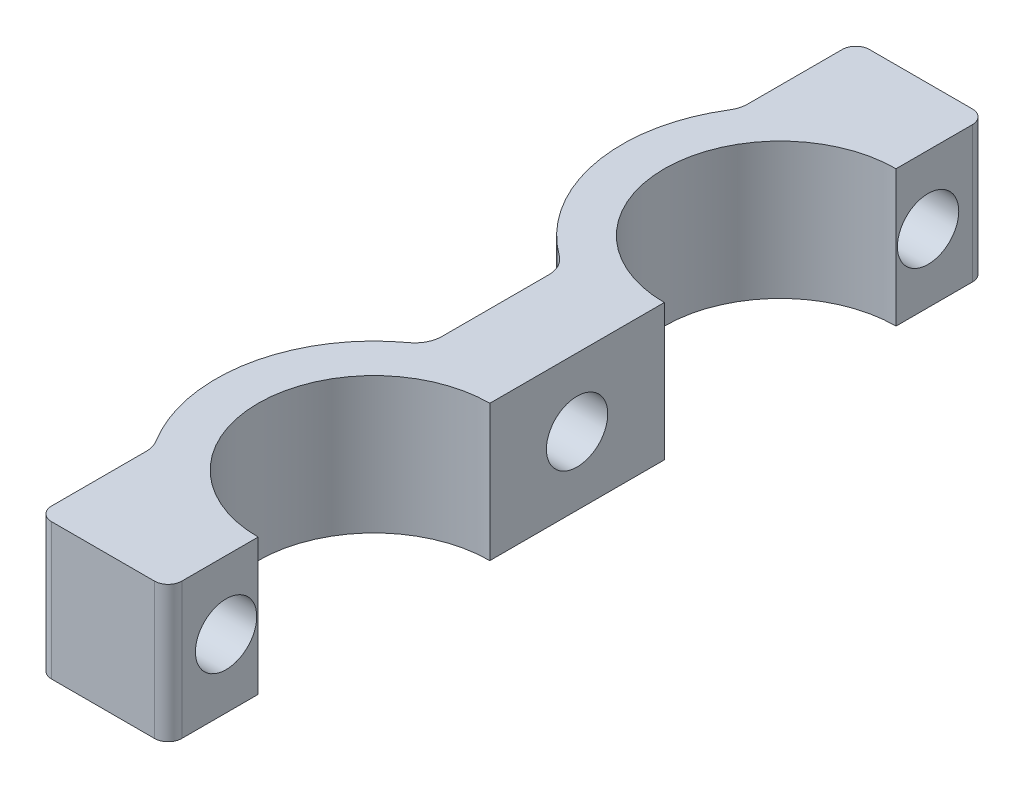
ISO-10303-21;
HEADER;
FILE_DESCRIPTION(('STEP AP214'),'2;1');
FILE_NAME('part.step','',(''),(''),'','','');
FILE_SCHEMA(('AUTOMOTIVE_DESIGN { 1 0 10303 214 1 1 1 1 }'));
ENDSEC;
DATA;
#1=APPLICATION_CONTEXT('core data for automotive mechanical design processes');
#2=APPLICATION_PROTOCOL_DEFINITION('international standard','automotive_design',2000,#1);
#3=PRODUCT_CONTEXT('',#1,'mechanical');
#4=PRODUCT('Part','Part','',(#3));
#5=PRODUCT_RELATED_PRODUCT_CATEGORY('part','',(#4));
#6=PRODUCT_DEFINITION_FORMATION('','',#4);
#7=PRODUCT_DEFINITION_CONTEXT('part definition',#1,'design');
#8=PRODUCT_DEFINITION('design','',#6,#7);
#9=PRODUCT_DEFINITION_SHAPE('','',#8);
#10=(LENGTH_UNIT() NAMED_UNIT(*) SI_UNIT(.MILLI.,.METRE.));
#11=(NAMED_UNIT(*) PLANE_ANGLE_UNIT() SI_UNIT($,.RADIAN.));
#12=(NAMED_UNIT(*) SI_UNIT($,.STERADIAN.) SOLID_ANGLE_UNIT());
#13=UNCERTAINTY_MEASURE_WITH_UNIT(LENGTH_MEASURE(1.E-05),#10,'distance_accuracy_value','');
#14=(GEOMETRIC_REPRESENTATION_CONTEXT(3) GLOBAL_UNCERTAINTY_ASSIGNED_CONTEXT((#13)) GLOBAL_UNIT_ASSIGNED_CONTEXT((#10,
#11,#12)) REPRESENTATION_CONTEXT('',''));
#15=CARTESIAN_POINT('',(0.,0.,0.));
#16=DIRECTION('',(0.,0.,1.));
#17=DIRECTION('',(1.,0.,0.));
#18=AXIS2_PLACEMENT_3D('',#15,#16,#17);
#19=CARTESIAN_POINT('',(0.,10.,0.));
#20=DIRECTION('',(-1.,0.,0.));
#21=DIRECTION('',(0.,0.,1.));
#22=AXIS2_PLACEMENT_3D('',#19,#20,#21);
#23=PLANE('',#22);
#24=DIRECTION('',(0.,0.,-1.));
#25=VECTOR('',#24,1.);
#26=CARTESIAN_POINT('',(0.,0.,0.));
#27=LINE('',#26,#25);
#28=CARTESIAN_POINT('',(0.,0.,-1.));
#29=VERTEX_POINT('',#28);
#30=CARTESIAN_POINT('',(0.,0.,-6.59999999999999));
#31=VERTEX_POINT('',#30);
#32=EDGE_CURVE('E209',#29,#31,#27,.T.);
#33=ORIENTED_EDGE('',*,*,#32,.T.);
#34=DIRECTION('',(0.,1.,0.));
#35=VECTOR('',#34,1.);
#36=CARTESIAN_POINT('',(0.,0.,-6.59999999999999));
#37=LINE('',#36,#35);
#38=CARTESIAN_POINT('',(0.,10.,-6.59999999999999));
#39=VERTEX_POINT('',#38);
#40=EDGE_CURVE('E348',#31,#39,#37,.T.);
#41=ORIENTED_EDGE('',*,*,#40,.T.);
#42=DIRECTION('',(0.,0.,-1.));
#43=VECTOR('',#42,1.);
#44=CARTESIAN_POINT('',(0.,10.,0.));
#45=LINE('',#44,#43);
#46=CARTESIAN_POINT('',(0.,10.,-1.));
#47=VERTEX_POINT('',#46);
#48=EDGE_CURVE('E333',#47,#39,#45,.T.);
#49=ORIENTED_EDGE('',*,*,#48,.F.);
#50=DIRECTION('',(0.,-1.,0.));
#51=VECTOR('',#50,1.);
#52=CARTESIAN_POINT('',(0.,10.,-1.));
#53=LINE('',#52,#51);
#54=EDGE_CURVE('E222',#47,#29,#53,.T.);
#55=ORIENTED_EDGE('',*,*,#54,.T.);
#56=EDGE_LOOP('',(#33,#41,#49,#55));
#57=FACE_BOUND('',#56,.T.);
#58=CARTESIAN_POINT('',(0.,5.,-4.25000000000001));
#59=DIRECTION('',(-1.,0.,0.));
#60=DIRECTION('',(0.,0.,-1.));
#61=AXIS2_PLACEMENT_3D('',#58,#59,#60);
#62=CIRCLE('',#61,2.25);
#63=CARTESIAN_POINT('',(0.,5.,-6.50000000000001));
#64=VERTEX_POINT('',#63);
#65=EDGE_CURVE('E221',#64,#64,#62,.T.);
#66=ORIENTED_EDGE('',*,*,#65,.T.);
#67=EDGE_LOOP('',(#66));
#68=FACE_BOUND('',#67,.T.);
#69=ADVANCED_FACE('F39',(#57,#68),#23,.F.);
#70=CARTESIAN_POINT('',(-9.54984471899927,10.,0.));
#71=DIRECTION('',(1.,0.,0.));
#72=DIRECTION('',(0.,0.,-1.));
#73=AXIS2_PLACEMENT_3D('',#70,#71,#72);
#74=PLANE('',#73);
#75=DIRECTION('',(0.,0.,1.));
#76=VECTOR('',#75,1.);
#77=CARTESIAN_POINT('',(-9.54984471899927,10.,0.));
#78=LINE('',#77,#76);
#79=CARTESIAN_POINT('',(-9.54984471899927,10.,-7.91939508349019));
#80=VERTEX_POINT('',#79);
#81=CARTESIAN_POINT('',(-9.54984471899927,10.,-1.));
#82=VERTEX_POINT('',#81);
#83=EDGE_CURVE('E312',#80,#82,#78,.T.);
#84=ORIENTED_EDGE('',*,*,#83,.F.);
#85=DIRECTION('',(0.,-1.,0.));
#86=VECTOR('',#85,1.);
#87=CARTESIAN_POINT('',(-9.54984471899927,10.,-7.91939508349019));
#88=LINE('',#87,#86);
#89=CARTESIAN_POINT('',(-9.54984471899927,0.,-7.91939508349019));
#90=VERTEX_POINT('',#89);
#91=EDGE_CURVE('E269',#80,#90,#88,.T.);
#92=ORIENTED_EDGE('',*,*,#91,.T.);
#93=DIRECTION('',(0.,0.,1.));
#94=VECTOR('',#93,1.);
#95=CARTESIAN_POINT('',(-9.54984471899927,0.,0.));
#96=LINE('',#95,#94);
#97=CARTESIAN_POINT('',(-9.54984471899927,0.,-1.));
#98=VERTEX_POINT('',#97);
#99=EDGE_CURVE('E216',#90,#98,#96,.T.);
#100=ORIENTED_EDGE('',*,*,#99,.T.);
#101=DIRECTION('',(0.,-1.,0.));
#102=VECTOR('',#101,1.);
#103=CARTESIAN_POINT('',(-9.54984471899927,10.,-1.));
#104=LINE('',#103,#102);
#105=EDGE_CURVE('E250',#98,#82,#104,.F.);
#106=ORIENTED_EDGE('',*,*,#105,.T.);
#107=EDGE_LOOP('',(#84,#92,#100,#106));
#108=FACE_BOUND('',#107,.T.);
#109=CARTESIAN_POINT('',(-9.54984471899927,5.,-4.25000000000001));
#110=DIRECTION('',(1.,0.,0.));
#111=DIRECTION('',(0.,0.,-1.));
#112=AXIS2_PLACEMENT_3D('',#109,#110,#111);
#113=CIRCLE('',#112,2.25);
#114=CARTESIAN_POINT('',(-9.54984471899927,5.,-6.50000000000001));
#115=VERTEX_POINT('',#114);
#116=EDGE_CURVE('E218',#115,#115,#113,.F.);
#117=ORIENTED_EDGE('',*,*,#116,.F.);
#118=EDGE_LOOP('',(#117));
#119=FACE_BOUND('',#118,.T.);
#120=ADVANCED_FACE('F392',(#108,#119),#74,.F.);
#121=CARTESIAN_POINT('',(0.,10.,-60.));
#122=DIRECTION('',(-1.,0.,0.));
#123=DIRECTION('',(0.,0.,1.));
#124=AXIS2_PLACEMENT_3D('',#121,#122,#123);
#125=PLANE('',#124);
#126=DIRECTION('',(0.,0.,-1.));
#127=VECTOR('',#126,1.);
#128=CARTESIAN_POINT('',(0.,10.,-60.));
#129=LINE('',#128,#127);
#130=CARTESIAN_POINT('',(0.,10.,-53.4));
#131=VERTEX_POINT('',#130);
#132=CARTESIAN_POINT('',(0.,10.,-59.));
#133=VERTEX_POINT('',#132);
#134=EDGE_CURVE('E196',#131,#133,#129,.T.);
#135=ORIENTED_EDGE('',*,*,#134,.F.);
#136=DIRECTION('',(0.,1.,0.));
#137=VECTOR('',#136,1.);
#138=CARTESIAN_POINT('',(0.,0.,-53.4));
#139=LINE('',#138,#137);
#140=CARTESIAN_POINT('',(0.,0.,-53.4));
#141=VERTEX_POINT('',#140);
#142=EDGE_CURVE('E179',#141,#131,#139,.T.);
#143=ORIENTED_EDGE('',*,*,#142,.F.);
#144=DIRECTION('',(0.,0.,-1.));
#145=VECTOR('',#144,1.);
#146=CARTESIAN_POINT('',(0.,0.,-60.));
#147=LINE('',#146,#145);
#148=CARTESIAN_POINT('',(0.,0.,-59.));
#149=VERTEX_POINT('',#148);
#150=EDGE_CURVE('E194',#141,#149,#147,.T.);
#151=ORIENTED_EDGE('',*,*,#150,.T.);
#152=DIRECTION('',(0.,-1.,0.));
#153=VECTOR('',#152,1.);
#154=CARTESIAN_POINT('',(0.,10.,-59.));
#155=LINE('',#154,#153);
#156=EDGE_CURVE('E240',#149,#133,#155,.F.);
#157=ORIENTED_EDGE('',*,*,#156,.T.);
#158=EDGE_LOOP('',(#135,#143,#151,#157));
#159=FACE_BOUND('',#158,.T.);
#160=CARTESIAN_POINT('',(0.,5.,-55.75));
#161=DIRECTION('',(-1.,0.,0.));
#162=DIRECTION('',(0.,0.,1.));
#163=AXIS2_PLACEMENT_3D('',#160,#161,#162);
#164=CIRCLE('',#163,2.25);
#165=CARTESIAN_POINT('',(0.,5.,-53.5));
#166=VERTEX_POINT('',#165);
#167=EDGE_CURVE('E217',#166,#166,#164,.T.);
#168=ORIENTED_EDGE('',*,*,#167,.T.);
#169=EDGE_LOOP('',(#168));
#170=FACE_BOUND('',#169,.T.);
#171=ADVANCED_FACE('F191',(#159,#170),#125,.F.);
#172=CARTESIAN_POINT('',(-9.54984471899922,10.,0.));
#173=DIRECTION('',(1.,0.,0.));
#174=DIRECTION('',(0.,0.,-1.));
#175=AXIS2_PLACEMENT_3D('',#172,#173,#174);
#176=PLANE('',#175);
#177=DIRECTION('',(0.,0.,1.));
#178=VECTOR('',#177,1.);
#179=CARTESIAN_POINT('',(-9.54984471899922,0.,0.));
#180=LINE('',#179,#178);
#181=CARTESIAN_POINT('',(-9.54984471899923,0.,-59.));
#182=VERTEX_POINT('',#181);
#183=CARTESIAN_POINT('',(-9.54984471899923,0.,-52.0806049165098));
#184=VERTEX_POINT('',#183);
#185=EDGE_CURVE('E316',#182,#184,#180,.T.);
#186=ORIENTED_EDGE('',*,*,#185,.T.);
#187=DIRECTION('',(0.,-1.,0.));
#188=VECTOR('',#187,1.);
#189=CARTESIAN_POINT('',(-9.54984471899923,10.,-52.0806049165098));
#190=LINE('',#189,#188);
#191=CARTESIAN_POINT('',(-9.54984471899923,10.,-52.0806049165098));
#192=VERTEX_POINT('',#191);
#193=EDGE_CURVE('E267',#184,#192,#190,.F.);
#194=ORIENTED_EDGE('',*,*,#193,.T.);
#195=DIRECTION('',(0.,0.,1.));
#196=VECTOR('',#195,1.);
#197=CARTESIAN_POINT('',(-9.54984471899922,10.,0.));
#198=LINE('',#197,#196);
#199=CARTESIAN_POINT('',(-9.54984471899923,10.,-59.));
#200=VERTEX_POINT('',#199);
#201=EDGE_CURVE('E322',#200,#192,#198,.T.);
#202=ORIENTED_EDGE('',*,*,#201,.F.);
#203=DIRECTION('',(0.,-1.,0.));
#204=VECTOR('',#203,1.);
#205=CARTESIAN_POINT('',(-9.54984471899923,10.,-59.));
#206=LINE('',#205,#204);
#207=EDGE_CURVE('E257',#200,#182,#206,.T.);
#208=ORIENTED_EDGE('',*,*,#207,.T.);
#209=EDGE_LOOP('',(#186,#194,#202,#208));
#210=FACE_BOUND('',#209,.T.);
#211=CARTESIAN_POINT('',(-9.54984471899923,5.,-55.75));
#212=DIRECTION('',(1.,0.,0.));
#213=DIRECTION('',(0.,0.,-1.));
#214=AXIS2_PLACEMENT_3D('',#211,#212,#213);
#215=CIRCLE('',#214,2.25);
#216=CARTESIAN_POINT('',(-9.54984471899923,5.,-58.));
#217=VERTEX_POINT('',#216);
#218=EDGE_CURVE('E213',#217,#217,#215,.F.);
#219=ORIENTED_EDGE('',*,*,#218,.F.);
#220=EDGE_LOOP('',(#219));
#221=FACE_BOUND('',#220,.T.);
#222=ADVANCED_FACE('F380',(#210,#221),#176,.F.);
#223=CARTESIAN_POINT('',(-3.,10.,0.));
#224=DIRECTION('',(0.,0.,-1.));
#225=DIRECTION('',(-1.,0.,0.));
#226=AXIS2_PLACEMENT_3D('',#223,#224,#225);
#227=PLANE('',#226);
#228=DIRECTION('',(1.,0.,0.));
#229=VECTOR('',#228,1.);
#230=CARTESIAN_POINT('',(-3.,10.,0.));
#231=LINE('',#230,#229);
#232=CARTESIAN_POINT('',(-8.54984471899927,10.,0.));
#233=VERTEX_POINT('',#232);
#234=CARTESIAN_POINT('',(-1.,10.,0.));
#235=VERTEX_POINT('',#234);
#236=EDGE_CURVE('E207',#233,#235,#231,.T.);
#237=ORIENTED_EDGE('',*,*,#236,.F.);
#238=DIRECTION('',(0.,-1.,0.));
#239=VECTOR('',#238,1.);
#240=CARTESIAN_POINT('',(-8.54984471899927,10.,0.));
#241=LINE('',#240,#239);
#242=CARTESIAN_POINT('',(-8.54984471899927,0.,0.));
#243=VERTEX_POINT('',#242);
#244=EDGE_CURVE('E242',#233,#243,#241,.T.);
#245=ORIENTED_EDGE('',*,*,#244,.T.);
#246=DIRECTION('',(1.,0.,0.));
#247=VECTOR('',#246,1.);
#248=CARTESIAN_POINT('',(-3.,0.,0.));
#249=LINE('',#248,#247);
#250=CARTESIAN_POINT('',(-1.,0.,0.));
#251=VERTEX_POINT('',#250);
#252=EDGE_CURVE('E325',#243,#251,#249,.T.);
#253=ORIENTED_EDGE('',*,*,#252,.T.);
#254=DIRECTION('',(0.,-1.,0.));
#255=VECTOR('',#254,1.);
#256=CARTESIAN_POINT('',(-1.,10.,0.));
#257=LINE('',#256,#255);
#258=EDGE_CURVE('E230',#251,#235,#257,.F.);
#259=ORIENTED_EDGE('',*,*,#258,.T.);
#260=EDGE_LOOP('',(#237,#245,#253,#259));
#261=FACE_BOUND('',#260,.T.);
#262=ADVANCED_FACE('F382',(#261),#227,.F.);
#263=CARTESIAN_POINT('',(0.,10.,-37.8));
#264=DIRECTION('',(-1.,0.,0.));
#265=DIRECTION('',(0.,0.,1.));
#266=AXIS2_PLACEMENT_3D('',#263,#264,#265);
#267=PLANE('',#266);
#268=CARTESIAN_POINT('',(0.,5.,-30.));
#269=DIRECTION('',(-1.,0.,0.));
#270=DIRECTION('',(0.,0.,1.));
#271=AXIS2_PLACEMENT_3D('',#268,#269,#270);
#272=CIRCLE('',#271,2.25);
#273=CARTESIAN_POINT('',(0.,5.,-27.75));
#274=VERTEX_POINT('',#273);
#275=EDGE_CURVE('E364',#274,#274,#272,.T.);
#276=ORIENTED_EDGE('',*,*,#275,.T.);
#277=EDGE_LOOP('',(#276));
#278=FACE_BOUND('',#277,.T.);
#279=DIRECTION('',(0.,0.,-1.));
#280=VECTOR('',#279,1.);
#281=CARTESIAN_POINT('',(0.,0.,-37.8));
#282=LINE('',#281,#280);
#283=CARTESIAN_POINT('',(0.,0.,-23.6));
#284=VERTEX_POINT('',#283);
#285=CARTESIAN_POINT('',(0.,0.,-36.4));
#286=VERTEX_POINT('',#285);
#287=EDGE_CURVE('E204',#284,#286,#282,.T.);
#288=ORIENTED_EDGE('',*,*,#287,.T.);
#289=DIRECTION('',(0.,1.,0.));
#290=VECTOR('',#289,1.);
#291=CARTESIAN_POINT('',(0.,0.,-36.4));
#292=LINE('',#291,#290);
#293=CARTESIAN_POINT('',(0.,10.,-36.4));
#294=VERTEX_POINT('',#293);
#295=EDGE_CURVE('E182',#286,#294,#292,.T.);
#296=ORIENTED_EDGE('',*,*,#295,.T.);
#297=DIRECTION('',(0.,0.,-1.));
#298=VECTOR('',#297,1.);
#299=CARTESIAN_POINT('',(0.,10.,-37.8));
#300=LINE('',#299,#298);
#301=CARTESIAN_POINT('',(0.,10.,-23.6));
#302=VERTEX_POINT('',#301);
#303=EDGE_CURVE('E336',#302,#294,#300,.T.);
#304=ORIENTED_EDGE('',*,*,#303,.F.);
#305=DIRECTION('',(0.,1.,0.));
#306=VECTOR('',#305,1.);
#307=CARTESIAN_POINT('',(0.,0.,-23.6));
#308=LINE('',#307,#306);
#309=EDGE_CURVE('E355',#284,#302,#308,.T.);
#310=ORIENTED_EDGE('',*,*,#309,.F.);
#311=EDGE_LOOP('',(#288,#296,#304,#310));
#312=FACE_BOUND('',#311,.T.);
#313=ADVANCED_FACE('F389',(#278,#312),#267,.F.);
#314=CARTESIAN_POINT('',(-3.,10.,-60.));
#315=DIRECTION('',(0.,0.,1.));
#316=DIRECTION('',(1.,0.,0.));
#317=AXIS2_PLACEMENT_3D('',#314,#315,#316);
#318=PLANE('',#317);
#319=DIRECTION('',(-1.,0.,0.));
#320=VECTOR('',#319,1.);
#321=CARTESIAN_POINT('',(-3.,0.,-60.));
#322=LINE('',#321,#320);
#323=CARTESIAN_POINT('',(-1.,0.,-60.));
#324=VERTEX_POINT('',#323);
#325=CARTESIAN_POINT('',(-8.54984471899923,0.,-60.));
#326=VERTEX_POINT('',#325);
#327=EDGE_CURVE('E203',#324,#326,#322,.T.);
#328=ORIENTED_EDGE('',*,*,#327,.T.);
#329=DIRECTION('',(0.,-1.,0.));
#330=VECTOR('',#329,1.);
#331=CARTESIAN_POINT('',(-8.54984471899923,10.,-60.));
#332=LINE('',#331,#330);
#333=CARTESIAN_POINT('',(-8.54984471899923,10.,-60.));
#334=VERTEX_POINT('',#333);
#335=EDGE_CURVE('E260',#326,#334,#332,.F.);
#336=ORIENTED_EDGE('',*,*,#335,.T.);
#337=DIRECTION('',(-1.,0.,0.));
#338=VECTOR('',#337,1.);
#339=CARTESIAN_POINT('',(-3.,10.,-60.));
#340=LINE('',#339,#338);
#341=CARTESIAN_POINT('',(-1.,10.,-60.));
#342=VERTEX_POINT('',#341);
#343=EDGE_CURVE('E225',#342,#334,#340,.T.);
#344=ORIENTED_EDGE('',*,*,#343,.F.);
#345=DIRECTION('',(0.,-1.,0.));
#346=VECTOR('',#345,1.);
#347=CARTESIAN_POINT('',(-1.,10.,-60.));
#348=LINE('',#347,#346);
#349=EDGE_CURVE('E237',#342,#324,#348,.T.);
#350=ORIENTED_EDGE('',*,*,#349,.T.);
#351=EDGE_LOOP('',(#328,#336,#344,#350));
#352=FACE_BOUND('',#351,.T.);
#353=ADVANCED_FACE('F448',(#352),#318,.F.);
#354=CARTESIAN_POINT('',(0.,10.,-15.1));
#355=DIRECTION('',(0.,-1.,0.));
#356=DIRECTION('',(0.,0.,-1.));
#357=AXIS2_PLACEMENT_3D('',#354,#355,#356);
#358=PLANE('',#357);
#359=CARTESIAN_POINT('',(0.,10.,-15.1));
#360=DIRECTION('',(0.,-1.,0.));
#361=DIRECTION('',(0.,0.,-1.));
#362=AXIS2_PLACEMENT_3D('',#359,#360,#361);
#363=CIRCLE('',#362,11.6);
#364=CARTESIAN_POINT('',(-9.85133814267585,10.,-8.97536639474163));
#365=VERTEX_POINT('',#364);
#366=CARTESIAN_POINT('',(-6.82352941176471,10.,-24.4808020108508));
#367=VERTEX_POINT('',#366);
#368=EDGE_CURVE('E306',#365,#367,#363,.T.);
#369=ORIENTED_EDGE('',*,*,#368,.F.);
#370=CARTESIAN_POINT('',(-11.5498447189993,10.,-7.91939508349019));
#371=DIRECTION('',(0.,-1.,0.));
#372=DIRECTION('',(0.,0.,-1.));
#373=AXIS2_PLACEMENT_3D('',#370,#371,#372);
#374=CIRCLE('',#373,2.);
#375=EDGE_CURVE('E287',#365,#80,#374,.T.);
#376=ORIENTED_EDGE('',*,*,#375,.T.);
#377=ORIENTED_EDGE('',*,*,#83,.T.);
#378=CARTESIAN_POINT('',(-8.54984471899927,10.,-1.));
#379=DIRECTION('',(0.,-1.,0.));
#380=DIRECTION('',(0.,0.,-1.));
#381=AXIS2_PLACEMENT_3D('',#378,#379,#380);
#382=CIRCLE('',#381,1.);
#383=EDGE_CURVE('E255',#82,#233,#382,.F.);
#384=ORIENTED_EDGE('',*,*,#383,.T.);
#385=ORIENTED_EDGE('',*,*,#236,.T.);
#386=CARTESIAN_POINT('',(-1.,10.,-1.));
#387=DIRECTION('',(0.,-1.,0.));
#388=DIRECTION('',(0.,0.,-1.));
#389=AXIS2_PLACEMENT_3D('',#386,#387,#388);
#390=CIRCLE('',#389,1.);
#391=EDGE_CURVE('E235',#235,#47,#390,.F.);
#392=ORIENTED_EDGE('',*,*,#391,.T.);
#393=ORIENTED_EDGE('',*,*,#48,.T.);
#394=CARTESIAN_POINT('',(0.,10.,-15.1));
#395=DIRECTION('',(0.,1.,0.));
#396=DIRECTION('',(0.,0.,1.));
#397=AXIS2_PLACEMENT_3D('',#394,#395,#396);
#398=CIRCLE('',#397,8.5);
#399=EDGE_CURVE('E356',#302,#39,#398,.T.);
#400=ORIENTED_EDGE('',*,*,#399,.F.);
#401=ORIENTED_EDGE('',*,*,#303,.T.);
#402=CARTESIAN_POINT('',(0.,10.,-44.9));
#403=DIRECTION('',(0.,1.,0.));
#404=DIRECTION('',(0.,0.,1.));
#405=AXIS2_PLACEMENT_3D('',#402,#403,#404);
#406=CIRCLE('',#405,8.49999999999999);
#407=EDGE_CURVE('E187',#131,#294,#406,.T.);
#408=ORIENTED_EDGE('',*,*,#407,.F.);
#409=ORIENTED_EDGE('',*,*,#134,.T.);
#410=CARTESIAN_POINT('',(-1.,10.,-59.));
#411=DIRECTION('',(0.,-1.,0.));
#412=DIRECTION('',(0.,0.,-1.));
#413=AXIS2_PLACEMENT_3D('',#410,#411,#412);
#414=CIRCLE('',#413,1.);
#415=EDGE_CURVE('E233',#133,#342,#414,.F.);
#416=ORIENTED_EDGE('',*,*,#415,.T.);
#417=ORIENTED_EDGE('',*,*,#343,.T.);
#418=CARTESIAN_POINT('',(-8.54984471899923,10.,-59.));
#419=DIRECTION('',(0.,-1.,0.));
#420=DIRECTION('',(0.,0.,-1.));
#421=AXIS2_PLACEMENT_3D('',#418,#419,#420);
#422=CIRCLE('',#421,1.);
#423=EDGE_CURVE('E253',#334,#200,#422,.F.);
#424=ORIENTED_EDGE('',*,*,#423,.T.);
#425=ORIENTED_EDGE('',*,*,#201,.T.);
#426=CARTESIAN_POINT('',(-11.5498447189992,10.,-52.0806049165098));
#427=DIRECTION('',(0.,-1.,0.));
#428=DIRECTION('',(0.,0.,-1.));
#429=AXIS2_PLACEMENT_3D('',#426,#427,#428);
#430=CIRCLE('',#429,2.);
#431=CARTESIAN_POINT('',(-9.85133814267581,10.,-51.0246336052584));
#432=VERTEX_POINT('',#431);
#433=EDGE_CURVE('E283',#192,#432,#430,.T.);
#434=ORIENTED_EDGE('',*,*,#433,.T.);
#435=CARTESIAN_POINT('',(0.,10.,-44.9));
#436=DIRECTION('',(0.,-1.,0.));
#437=DIRECTION('',(0.,0.,-1.));
#438=AXIS2_PLACEMENT_3D('',#435,#436,#437);
#439=CIRCLE('',#438,11.6);
#440=CARTESIAN_POINT('',(-6.82352941176471,10.,-35.5191979891492));
#441=VERTEX_POINT('',#440);
#442=EDGE_CURVE('E314',#441,#432,#439,.T.);
#443=ORIENTED_EDGE('',*,*,#442,.F.);
#444=CARTESIAN_POINT('',(-8.00000000000001,10.,-33.901818332106));
#445=DIRECTION('',(0.,-1.,0.));
#446=DIRECTION('',(0.,0.,-1.));
#447=AXIS2_PLACEMENT_3D('',#444,#445,#446);
#448=CIRCLE('',#447,2.);
#449=CARTESIAN_POINT('',(-6.00000000000001,10.,-33.901818332106));
#450=VERTEX_POINT('',#449);
#451=EDGE_CURVE('E61',#441,#450,#448,.T.);
#452=ORIENTED_EDGE('',*,*,#451,.T.);
#453=DIRECTION('',(0.,0.,1.));
#454=VECTOR('',#453,1.);
#455=CARTESIAN_POINT('',(-6.00000000000001,10.,0.));
#456=LINE('',#455,#454);
#457=CARTESIAN_POINT('',(-6.00000000000001,10.,-26.098181667894));
#458=VERTEX_POINT('',#457);
#459=EDGE_CURVE('E308',#450,#458,#456,.T.);
#460=ORIENTED_EDGE('',*,*,#459,.T.);
#461=CARTESIAN_POINT('',(-8.00000000000001,10.,-26.098181667894));
#462=DIRECTION('',(0.,-1.,0.));
#463=DIRECTION('',(0.,0.,-1.));
#464=AXIS2_PLACEMENT_3D('',#461,#462,#463);
#465=CIRCLE('',#464,2.);
#466=EDGE_CURVE('E11',#458,#367,#465,.T.);
#467=ORIENTED_EDGE('',*,*,#466,.T.);
#468=EDGE_LOOP('',(#369,#376,#377,#384,#385,#392,#393,#400,#401,#408,#409,#416,#417,#424,#425,
#434,#443,#452,#460,#467));
#469=FACE_BOUND('',#468,.T.);
#470=ADVANCED_FACE('F305',(#469),#358,.F.);
#471=CARTESIAN_POINT('',(0.,0.,-15.1));
#472=DIRECTION('',(0.,-1.,0.));
#473=DIRECTION('',(0.,0.,-1.));
#474=AXIS2_PLACEMENT_3D('',#471,#472,#473);
#475=PLANE('',#474);
#476=ORIENTED_EDGE('',*,*,#252,.F.);
#477=CARTESIAN_POINT('',(-8.54984471899927,0.,-1.));
#478=DIRECTION('',(0.,-1.,0.));
#479=DIRECTION('',(0.,0.,-1.));
#480=AXIS2_PLACEMENT_3D('',#477,#478,#479);
#481=CIRCLE('',#480,1.);
#482=EDGE_CURVE('E247',#243,#98,#481,.T.);
#483=ORIENTED_EDGE('',*,*,#482,.T.);
#484=ORIENTED_EDGE('',*,*,#99,.F.);
#485=CARTESIAN_POINT('',(-11.5498447189993,0.,-7.91939508349019));
#486=DIRECTION('',(0.,-1.,0.));
#487=DIRECTION('',(0.,0.,-1.));
#488=AXIS2_PLACEMENT_3D('',#485,#486,#487);
#489=CIRCLE('',#488,2.);
#490=CARTESIAN_POINT('',(-9.85133814267585,0.,-8.97536639474163));
#491=VERTEX_POINT('',#490);
#492=EDGE_CURVE('E285',#90,#491,#489,.F.);
#493=ORIENTED_EDGE('',*,*,#492,.T.);
#494=CARTESIAN_POINT('',(0.,0.,-15.1));
#495=DIRECTION('',(0.,-1.,0.));
#496=DIRECTION('',(0.,0.,-1.));
#497=AXIS2_PLACEMENT_3D('',#494,#495,#496);
#498=CIRCLE('',#497,11.6);
#499=CARTESIAN_POINT('',(-6.82352941176471,0.,-24.4808020108508));
#500=VERTEX_POINT('',#499);
#501=EDGE_CURVE('E295',#491,#500,#498,.T.);
#502=ORIENTED_EDGE('',*,*,#501,.T.);
#503=CARTESIAN_POINT('',(-8.00000000000001,0.,-26.098181667894));
#504=DIRECTION('',(0.,-1.,0.));
#505=DIRECTION('',(0.,0.,-1.));
#506=AXIS2_PLACEMENT_3D('',#503,#504,#505);
#507=CIRCLE('',#506,2.);
#508=CARTESIAN_POINT('',(-6.00000000000001,0.,-26.098181667894));
#509=VERTEX_POINT('',#508);
#510=EDGE_CURVE('E47',#500,#509,#507,.F.);
#511=ORIENTED_EDGE('',*,*,#510,.T.);
#512=DIRECTION('',(0.,0.,1.));
#513=VECTOR('',#512,1.);
#514=CARTESIAN_POINT('',(-6.00000000000001,0.,0.));
#515=LINE('',#514,#513);
#516=CARTESIAN_POINT('',(-6.00000000000001,0.,-33.901818332106));
#517=VERTEX_POINT('',#516);
#518=EDGE_CURVE('E293',#517,#509,#515,.T.);
#519=ORIENTED_EDGE('',*,*,#518,.F.);
#520=CARTESIAN_POINT('',(-8.00000000000001,0.,-33.901818332106));
#521=DIRECTION('',(0.,-1.,0.));
#522=DIRECTION('',(0.,0.,-1.));
#523=AXIS2_PLACEMENT_3D('',#520,#521,#522);
#524=CIRCLE('',#523,2.);
#525=CARTESIAN_POINT('',(-6.82352941176471,0.,-35.5191979891492));
#526=VERTEX_POINT('',#525);
#527=EDGE_CURVE('E289',#517,#526,#524,.F.);
#528=ORIENTED_EDGE('',*,*,#527,.T.);
#529=CARTESIAN_POINT('',(0.,0.,-44.9));
#530=DIRECTION('',(0.,-1.,0.));
#531=DIRECTION('',(0.,0.,-1.));
#532=AXIS2_PLACEMENT_3D('',#529,#530,#531);
#533=CIRCLE('',#532,11.6);
#534=CARTESIAN_POINT('',(-9.85133814267581,0.,-51.0246336052584));
#535=VERTEX_POINT('',#534);
#536=EDGE_CURVE('E300',#526,#535,#533,.T.);
#537=ORIENTED_EDGE('',*,*,#536,.T.);
#538=CARTESIAN_POINT('',(-11.5498447189992,0.,-52.0806049165098));
#539=DIRECTION('',(0.,-1.,0.));
#540=DIRECTION('',(0.,0.,-1.));
#541=AXIS2_PLACEMENT_3D('',#538,#539,#540);
#542=CIRCLE('',#541,2.);
#543=EDGE_CURVE('E281',#535,#184,#542,.F.);
#544=ORIENTED_EDGE('',*,*,#543,.T.);
#545=ORIENTED_EDGE('',*,*,#185,.F.);
#546=CARTESIAN_POINT('',(-8.54984471899923,0.,-59.));
#547=DIRECTION('',(0.,-1.,0.));
#548=DIRECTION('',(0.,0.,-1.));
#549=AXIS2_PLACEMENT_3D('',#546,#547,#548);
#550=CIRCLE('',#549,1.);
#551=EDGE_CURVE('E245',#182,#326,#550,.T.);
#552=ORIENTED_EDGE('',*,*,#551,.T.);
#553=ORIENTED_EDGE('',*,*,#327,.F.);
#554=CARTESIAN_POINT('',(-1.,0.,-59.));
#555=DIRECTION('',(0.,-1.,0.));
#556=DIRECTION('',(0.,0.,-1.));
#557=AXIS2_PLACEMENT_3D('',#554,#555,#556);
#558=CIRCLE('',#557,1.);
#559=EDGE_CURVE('E201',#324,#149,#558,.T.);
#560=ORIENTED_EDGE('',*,*,#559,.T.);
#561=ORIENTED_EDGE('',*,*,#150,.F.);
#562=CARTESIAN_POINT('',(0.,0.,-44.9));
#563=DIRECTION('',(0.,1.,0.));
#564=DIRECTION('',(0.,0.,1.));
#565=AXIS2_PLACEMENT_3D('',#562,#563,#564);
#566=CIRCLE('',#565,8.49999999999999);
#567=EDGE_CURVE('E176',#141,#286,#566,.T.);
#568=ORIENTED_EDGE('',*,*,#567,.T.);
#569=ORIENTED_EDGE('',*,*,#287,.F.);
#570=CARTESIAN_POINT('',(0.,0.,-15.1));
#571=DIRECTION('',(0.,1.,0.));
#572=DIRECTION('',(0.,0.,1.));
#573=AXIS2_PLACEMENT_3D('',#570,#571,#572);
#574=CIRCLE('',#573,8.5);
#575=EDGE_CURVE('E352',#284,#31,#574,.T.);
#576=ORIENTED_EDGE('',*,*,#575,.T.);
#577=ORIENTED_EDGE('',*,*,#32,.F.);
#578=CARTESIAN_POINT('',(-1.,0.,-1.));
#579=DIRECTION('',(0.,-1.,0.));
#580=DIRECTION('',(0.,0.,-1.));
#581=AXIS2_PLACEMENT_3D('',#578,#579,#580);
#582=CIRCLE('',#581,1.);
#583=EDGE_CURVE('E227',#29,#251,#582,.T.);
#584=ORIENTED_EDGE('',*,*,#583,.T.);
#585=EDGE_LOOP('',(#476,#483,#484,#493,#502,#511,#519,#528,#537,#544,#545,#552,#553,#560,#561,
#568,#569,#576,#577,#584));
#586=FACE_BOUND('',#585,.T.);
#587=ADVANCED_FACE('F199',(#586),#475,.T.);
#588=CARTESIAN_POINT('',(0.,10.,-44.9));
#589=DIRECTION('',(0.,-1.,0.));
#590=DIRECTION('',(0.,0.,-1.));
#591=AXIS2_PLACEMENT_3D('',#588,#589,#590);
#592=CYLINDRICAL_SURFACE('',#591,11.6);
#593=ORIENTED_EDGE('',*,*,#442,.T.);
#594=DIRECTION('',(0.,-1.,0.));
#595=VECTOR('',#594,1.);
#596=CARTESIAN_POINT('',(-9.85133814267581,10.,-51.0246336052584));
#597=LINE('',#596,#595);
#598=EDGE_CURVE('E264',#432,#535,#597,.T.);
#599=ORIENTED_EDGE('',*,*,#598,.T.);
#600=ORIENTED_EDGE('',*,*,#536,.F.);
#601=DIRECTION('',(0.,-1.,0.));
#602=VECTOR('',#601,1.);
#603=CARTESIAN_POINT('',(-6.82352941176471,10.,-35.5191979891492));
#604=LINE('',#603,#602);
#605=EDGE_CURVE('E262',#526,#441,#604,.F.);
#606=ORIENTED_EDGE('',*,*,#605,.T.);
#607=EDGE_LOOP('',(#593,#599,#600,#606));
#608=FACE_BOUND('',#607,.T.);
#609=ADVANCED_FACE('F438',(#608),#592,.T.);
#610=CARTESIAN_POINT('',(-6.00000000000001,10.,0.));
#611=DIRECTION('',(1.,0.,0.));
#612=DIRECTION('',(0.,0.,-1.));
#613=AXIS2_PLACEMENT_3D('',#610,#611,#612);
#614=PLANE('',#613);
#615=CARTESIAN_POINT('',(-6.00000000000002,5.,-30.));
#616=DIRECTION('',(-1.,0.,0.));
#617=DIRECTION('',(0.,0.,1.));
#618=AXIS2_PLACEMENT_3D('',#615,#616,#617);
#619=CIRCLE('',#618,2.25);
#620=CARTESIAN_POINT('',(-6.00000000000002,5.,-27.75));
#621=VERTEX_POINT('',#620);
#622=EDGE_CURVE('E362',#621,#621,#619,.T.);
#623=ORIENTED_EDGE('',*,*,#622,.F.);
#624=EDGE_LOOP('',(#623));
#625=FACE_BOUND('',#624,.T.);
#626=ORIENTED_EDGE('',*,*,#459,.F.);
#627=DIRECTION('',(0.,-1.,0.));
#628=VECTOR('',#627,1.);
#629=CARTESIAN_POINT('',(-6.00000000000001,10.,-33.901818332106));
#630=LINE('',#629,#628);
#631=EDGE_CURVE('E278',#450,#517,#630,.T.);
#632=ORIENTED_EDGE('',*,*,#631,.T.);
#633=ORIENTED_EDGE('',*,*,#518,.T.);
#634=DIRECTION('',(0.,-1.,0.));
#635=VECTOR('',#634,1.);
#636=CARTESIAN_POINT('',(-6.00000000000001,10.,-26.098181667894));
#637=LINE('',#636,#635);
#638=EDGE_CURVE('E54',#509,#458,#637,.F.);
#639=ORIENTED_EDGE('',*,*,#638,.T.);
#640=EDGE_LOOP('',(#626,#632,#633,#639));
#641=FACE_BOUND('',#640,.T.);
#642=ADVANCED_FACE('F298',(#625,#641),#614,.F.);
#643=CARTESIAN_POINT('',(0.,10.,-15.1));
#644=DIRECTION('',(0.,-1.,0.));
#645=DIRECTION('',(0.,0.,-1.));
#646=AXIS2_PLACEMENT_3D('',#643,#644,#645);
#647=CYLINDRICAL_SURFACE('',#646,11.6);
#648=ORIENTED_EDGE('',*,*,#501,.F.);
#649=DIRECTION('',(0.,-1.,0.));
#650=VECTOR('',#649,1.);
#651=CARTESIAN_POINT('',(-9.85133814267585,10.,-8.97536639474163));
#652=LINE('',#651,#650);
#653=EDGE_CURVE('E275',#491,#365,#652,.F.);
#654=ORIENTED_EDGE('',*,*,#653,.T.);
#655=ORIENTED_EDGE('',*,*,#368,.T.);
#656=DIRECTION('',(0.,-1.,0.));
#657=VECTOR('',#656,1.);
#658=CARTESIAN_POINT('',(-6.82352941176471,10.,-24.4808020108508));
#659=LINE('',#658,#657);
#660=EDGE_CURVE('E272',#367,#500,#659,.T.);
#661=ORIENTED_EDGE('',*,*,#660,.T.);
#662=EDGE_LOOP('',(#648,#654,#655,#661));
#663=FACE_BOUND('',#662,.T.);
#664=ADVANCED_FACE('F310',(#663),#647,.T.);
#665=CARTESIAN_POINT('',(-11.6,5.,-55.75));
#666=DIRECTION('',(1.,0.,0.));
#667=DIRECTION('',(0.,0.,-1.));
#668=AXIS2_PLACEMENT_3D('',#665,#666,#667);
#669=CYLINDRICAL_SURFACE('',#668,2.25);
#670=ORIENTED_EDGE('',*,*,#167,.F.);
#671=EDGE_LOOP('',(#670));
#672=FACE_BOUND('',#671,.T.);
#673=ORIENTED_EDGE('',*,*,#218,.T.);
#674=EDGE_LOOP('',(#673));
#675=FACE_BOUND('',#674,.T.);
#676=ADVANCED_FACE('F373',(#672,#675),#669,.F.);
#677=CARTESIAN_POINT('',(-11.6,5.,-4.25000000000001));
#678=DIRECTION('',(1.,0.,0.));
#679=DIRECTION('',(0.,0.,-1.));
#680=AXIS2_PLACEMENT_3D('',#677,#678,#679);
#681=CYLINDRICAL_SURFACE('',#680,2.25);
#682=ORIENTED_EDGE('',*,*,#65,.F.);
#683=EDGE_LOOP('',(#682));
#684=FACE_BOUND('',#683,.T.);
#685=ORIENTED_EDGE('',*,*,#116,.T.);
#686=EDGE_LOOP('',(#685));
#687=FACE_BOUND('',#686,.T.);
#688=ADVANCED_FACE('F376',(#684,#687),#681,.F.);
#689=CARTESIAN_POINT('',(0.,5.,-30.));
#690=DIRECTION('',(-1.,0.,0.));
#691=DIRECTION('',(0.,0.,1.));
#692=AXIS2_PLACEMENT_3D('',#689,#690,#691);
#693=CYLINDRICAL_SURFACE('',#692,2.25);
#694=ORIENTED_EDGE('',*,*,#275,.F.);
#695=EDGE_LOOP('',(#694));
#696=FACE_BOUND('',#695,.T.);
#697=ORIENTED_EDGE('',*,*,#622,.T.);
#698=EDGE_LOOP('',(#697));
#699=FACE_BOUND('',#698,.T.);
#700=ADVANCED_FACE('F408',(#696,#699),#693,.F.);
#701=CARTESIAN_POINT('',(-1.,10.,-1.));
#702=DIRECTION('',(0.,-1.,0.));
#703=DIRECTION('',(0.,0.,-1.));
#704=AXIS2_PLACEMENT_3D('',#701,#702,#703);
#705=CYLINDRICAL_SURFACE('',#704,1.);
#706=ORIENTED_EDGE('',*,*,#391,.F.);
#707=ORIENTED_EDGE('',*,*,#258,.F.);
#708=ORIENTED_EDGE('',*,*,#583,.F.);
#709=ORIENTED_EDGE('',*,*,#54,.F.);
#710=EDGE_LOOP('',(#706,#707,#708,#709));
#711=FACE_BOUND('',#710,.T.);
#712=ADVANCED_FACE('F404',(#711),#705,.T.);
#713=CARTESIAN_POINT('',(-1.,10.,-59.));
#714=DIRECTION('',(0.,-1.,0.));
#715=DIRECTION('',(0.,0.,-1.));
#716=AXIS2_PLACEMENT_3D('',#713,#714,#715);
#717=CYLINDRICAL_SURFACE('',#716,1.);
#718=ORIENTED_EDGE('',*,*,#415,.F.);
#719=ORIENTED_EDGE('',*,*,#156,.F.);
#720=ORIENTED_EDGE('',*,*,#559,.F.);
#721=ORIENTED_EDGE('',*,*,#349,.F.);
#722=EDGE_LOOP('',(#718,#719,#720,#721));
#723=FACE_BOUND('',#722,.T.);
#724=ADVANCED_FACE('F407',(#723),#717,.T.);
#725=CARTESIAN_POINT('',(0.,0.,-15.1));
#726=DIRECTION('',(0.,1.,0.));
#727=DIRECTION('',(0.,0.,1.));
#728=AXIS2_PLACEMENT_3D('',#725,#726,#727);
#729=CYLINDRICAL_SURFACE('',#728,8.5);
#730=ORIENTED_EDGE('',*,*,#399,.T.);
#731=ORIENTED_EDGE('',*,*,#40,.F.);
#732=ORIENTED_EDGE('',*,*,#575,.F.);
#733=ORIENTED_EDGE('',*,*,#309,.T.);
#734=EDGE_LOOP('',(#730,#731,#732,#733));
#735=FACE_BOUND('',#734,.T.);
#736=ADVANCED_FACE('F412',(#735),#729,.F.);
#737=CARTESIAN_POINT('',(0.,0.,-44.9));
#738=DIRECTION('',(0.,1.,0.));
#739=DIRECTION('',(0.,0.,1.));
#740=AXIS2_PLACEMENT_3D('',#737,#738,#739);
#741=CYLINDRICAL_SURFACE('',#740,8.49999999999999);
#742=ORIENTED_EDGE('',*,*,#407,.T.);
#743=ORIENTED_EDGE('',*,*,#295,.F.);
#744=ORIENTED_EDGE('',*,*,#567,.F.);
#745=ORIENTED_EDGE('',*,*,#142,.T.);
#746=EDGE_LOOP('',(#742,#743,#744,#745));
#747=FACE_BOUND('',#746,.T.);
#748=ADVANCED_FACE('F178',(#747),#741,.F.);
#749=CARTESIAN_POINT('',(-8.54984471899927,10.,-1.));
#750=DIRECTION('',(0.,-1.,0.));
#751=DIRECTION('',(0.,0.,-1.));
#752=AXIS2_PLACEMENT_3D('',#749,#750,#751);
#753=CYLINDRICAL_SURFACE('',#752,1.);
#754=ORIENTED_EDGE('',*,*,#383,.F.);
#755=ORIENTED_EDGE('',*,*,#105,.F.);
#756=ORIENTED_EDGE('',*,*,#482,.F.);
#757=ORIENTED_EDGE('',*,*,#244,.F.);
#758=EDGE_LOOP('',(#754,#755,#756,#757));
#759=FACE_BOUND('',#758,.T.);
#760=ADVANCED_FACE('F414',(#759),#753,.T.);
#761=CARTESIAN_POINT('',(-8.54984471899923,10.,-59.));
#762=DIRECTION('',(0.,-1.,0.));
#763=DIRECTION('',(0.,0.,-1.));
#764=AXIS2_PLACEMENT_3D('',#761,#762,#763);
#765=CYLINDRICAL_SURFACE('',#764,1.);
#766=ORIENTED_EDGE('',*,*,#423,.F.);
#767=ORIENTED_EDGE('',*,*,#335,.F.);
#768=ORIENTED_EDGE('',*,*,#551,.F.);
#769=ORIENTED_EDGE('',*,*,#207,.F.);
#770=EDGE_LOOP('',(#766,#767,#768,#769));
#771=FACE_BOUND('',#770,.T.);
#772=ADVANCED_FACE('F417',(#771),#765,.T.);
#773=CARTESIAN_POINT('',(-11.5498447189992,10.,-52.0806049165098));
#774=DIRECTION('',(0.,-1.,0.));
#775=DIRECTION('',(0.,0.,-1.));
#776=AXIS2_PLACEMENT_3D('',#773,#774,#775);
#777=CYLINDRICAL_SURFACE('',#776,2.);
#778=ORIENTED_EDGE('',*,*,#433,.F.);
#779=ORIENTED_EDGE('',*,*,#193,.F.);
#780=ORIENTED_EDGE('',*,*,#543,.F.);
#781=ORIENTED_EDGE('',*,*,#598,.F.);
#782=EDGE_LOOP('',(#778,#779,#780,#781));
#783=FACE_BOUND('',#782,.T.);
#784=ADVANCED_FACE('F421',(#783),#777,.F.);
#785=CARTESIAN_POINT('',(-11.5498447189993,10.,-7.91939508349019));
#786=DIRECTION('',(0.,-1.,0.));
#787=DIRECTION('',(0.,0.,-1.));
#788=AXIS2_PLACEMENT_3D('',#785,#786,#787);
#789=CYLINDRICAL_SURFACE('',#788,2.);
#790=ORIENTED_EDGE('',*,*,#375,.F.);
#791=ORIENTED_EDGE('',*,*,#653,.F.);
#792=ORIENTED_EDGE('',*,*,#492,.F.);
#793=ORIENTED_EDGE('',*,*,#91,.F.);
#794=EDGE_LOOP('',(#790,#791,#792,#793));
#795=FACE_BOUND('',#794,.T.);
#796=ADVANCED_FACE('F425',(#795),#789,.F.);
#797=CARTESIAN_POINT('',(-8.00000000000001,10.,-33.901818332106));
#798=DIRECTION('',(0.,-1.,0.));
#799=DIRECTION('',(0.,0.,-1.));
#800=AXIS2_PLACEMENT_3D('',#797,#798,#799);
#801=CYLINDRICAL_SURFACE('',#800,2.);
#802=ORIENTED_EDGE('',*,*,#451,.F.);
#803=ORIENTED_EDGE('',*,*,#605,.F.);
#804=ORIENTED_EDGE('',*,*,#527,.F.);
#805=ORIENTED_EDGE('',*,*,#631,.F.);
#806=EDGE_LOOP('',(#802,#803,#804,#805));
#807=FACE_BOUND('',#806,.T.);
#808=ADVANCED_FACE('F428',(#807),#801,.F.);
#809=CARTESIAN_POINT('',(-8.00000000000001,10.,-26.098181667894));
#810=DIRECTION('',(0.,-1.,0.));
#811=DIRECTION('',(0.,0.,-1.));
#812=AXIS2_PLACEMENT_3D('',#809,#810,#811);
#813=CYLINDRICAL_SURFACE('',#812,2.);
#814=ORIENTED_EDGE('',*,*,#466,.F.);
#815=ORIENTED_EDGE('',*,*,#638,.F.);
#816=ORIENTED_EDGE('',*,*,#510,.F.);
#817=ORIENTED_EDGE('',*,*,#660,.F.);
#818=EDGE_LOOP('',(#814,#815,#816,#817));
#819=FACE_BOUND('',#818,.T.);
#820=ADVANCED_FACE('F41',(#819),#813,.F.);
#821=CLOSED_SHELL('',(#69,#120,#171,#222,#262,#313,#353,#470,#587,#609,#642,#664,#676,#688,#700,
#712,#724,#736,#748,#760,#772,#784,#796,#808,#820));
#822=MANIFOLD_SOLID_BREP('B2',#821);
#823=ADVANCED_BREP_SHAPE_REPRESENTATION('',(#18,#822),#14);
#824=SHAPE_DEFINITION_REPRESENTATION(#9,#823);
ENDSEC;
END-ISO-10303-21;
